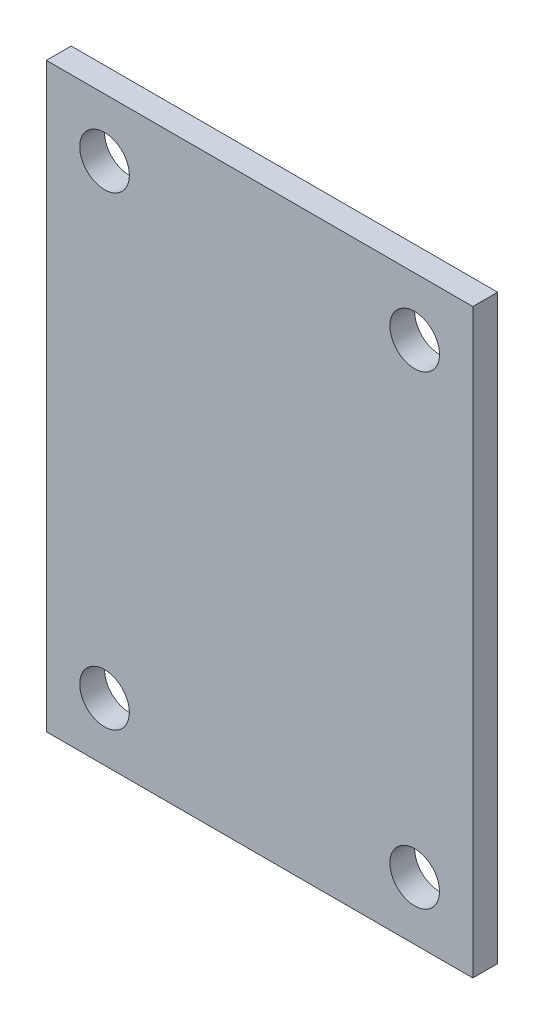
ISO-10303-21;
HEADER;
FILE_DESCRIPTION(('STEP AP214'),'2;1');
FILE_NAME('part.step','',(''),(''),'','','');
FILE_SCHEMA(('AUTOMOTIVE_DESIGN { 1 0 10303 214 1 1 1 1 }'));
ENDSEC;
DATA;
#1=APPLICATION_CONTEXT('core data for automotive mechanical design processes');
#2=APPLICATION_PROTOCOL_DEFINITION('international standard','automotive_design',2000,#1);
#3=PRODUCT_CONTEXT('',#1,'mechanical');
#4=PRODUCT('Part','Part','',(#3));
#5=PRODUCT_RELATED_PRODUCT_CATEGORY('part','',(#4));
#6=PRODUCT_DEFINITION_FORMATION('','',#4);
#7=PRODUCT_DEFINITION_CONTEXT('part definition',#1,'design');
#8=PRODUCT_DEFINITION('design','',#6,#7);
#9=PRODUCT_DEFINITION_SHAPE('','',#8);
#10=(LENGTH_UNIT() NAMED_UNIT(*) SI_UNIT(.MILLI.,.METRE.));
#11=(NAMED_UNIT(*) PLANE_ANGLE_UNIT() SI_UNIT($,.RADIAN.));
#12=(NAMED_UNIT(*) SI_UNIT($,.STERADIAN.) SOLID_ANGLE_UNIT());
#13=UNCERTAINTY_MEASURE_WITH_UNIT(LENGTH_MEASURE(1.E-05),#10,'distance_accuracy_value','');
#14=(GEOMETRIC_REPRESENTATION_CONTEXT(3) GLOBAL_UNCERTAINTY_ASSIGNED_CONTEXT((#13)) GLOBAL_UNIT_ASSIGNED_CONTEXT((#10,
#11,#12)) REPRESENTATION_CONTEXT('',''));
#15=CARTESIAN_POINT('',(0.,0.,0.));
#16=DIRECTION('',(0.,0.,1.));
#17=DIRECTION('',(1.,0.,0.));
#18=AXIS2_PLACEMENT_3D('',#15,#16,#17);
#19=CARTESIAN_POINT('',(13.75,18.75,1.6));
#20=DIRECTION('',(0.,0.,-1.));
#21=DIRECTION('',(-1.,0.,0.));
#22=AXIS2_PLACEMENT_3D('',#19,#20,#21);
#23=PLANE('',#22);
#24=CARTESIAN_POINT('',(10.,-15.,1.6));
#25=DIRECTION('',(0.,0.,1.));
#26=DIRECTION('',(1.,0.,0.));
#27=AXIS2_PLACEMENT_3D('',#24,#25,#26);
#28=CIRCLE('',#27,1.6);
#29=CARTESIAN_POINT('',(11.6,-15.,1.6));
#30=VERTEX_POINT('',#29);
#31=EDGE_CURVE('E119',#30,#30,#28,.T.);
#32=ORIENTED_EDGE('',*,*,#31,.F.);
#33=EDGE_LOOP('',(#32));
#34=FACE_BOUND('',#33,.T.);
#35=CARTESIAN_POINT('',(-10.,15.,1.6));
#36=DIRECTION('',(0.,0.,1.));
#37=DIRECTION('',(1.,0.,0.));
#38=AXIS2_PLACEMENT_3D('',#35,#36,#37);
#39=CIRCLE('',#38,1.6);
#40=CARTESIAN_POINT('',(-8.4,15.,1.6));
#41=VERTEX_POINT('',#40);
#42=EDGE_CURVE('E98',#41,#41,#39,.T.);
#43=ORIENTED_EDGE('',*,*,#42,.F.);
#44=EDGE_LOOP('',(#43));
#45=FACE_BOUND('',#44,.T.);
#46=DIRECTION('',(0.,1.,0.));
#47=VECTOR('',#46,1.);
#48=CARTESIAN_POINT('',(13.75,-18.75,1.6));
#49=LINE('',#48,#47);
#50=CARTESIAN_POINT('',(13.75,-18.75,1.6));
#51=VERTEX_POINT('',#50);
#52=CARTESIAN_POINT('',(13.75,18.75,1.6));
#53=VERTEX_POINT('',#52);
#54=EDGE_CURVE('E83',#51,#53,#49,.T.);
#55=ORIENTED_EDGE('',*,*,#54,.T.);
#56=DIRECTION('',(-1.,0.,0.));
#57=VECTOR('',#56,1.);
#58=CARTESIAN_POINT('',(-13.75,18.75,1.6));
#59=LINE('',#58,#57);
#60=CARTESIAN_POINT('',(-13.75,18.75,1.6));
#61=VERTEX_POINT('',#60);
#62=EDGE_CURVE('E78',#53,#61,#59,.T.);
#63=ORIENTED_EDGE('',*,*,#62,.T.);
#64=DIRECTION('',(0.,-1.,0.));
#65=VECTOR('',#64,1.);
#66=CARTESIAN_POINT('',(-13.75,-18.75,1.6));
#67=LINE('',#66,#65);
#68=CARTESIAN_POINT('',(-13.75,-18.75,1.6));
#69=VERTEX_POINT('',#68);
#70=EDGE_CURVE('E81',#61,#69,#67,.T.);
#71=ORIENTED_EDGE('',*,*,#70,.T.);
#72=DIRECTION('',(1.,0.,0.));
#73=VECTOR('',#72,1.);
#74=CARTESIAN_POINT('',(-13.75,-18.75,1.6));
#75=LINE('',#74,#73);
#76=EDGE_CURVE('E48',#69,#51,#75,.T.);
#77=ORIENTED_EDGE('',*,*,#76,.T.);
#78=EDGE_LOOP('',(#55,#63,#71,#77));
#79=FACE_BOUND('',#78,.T.);
#80=CARTESIAN_POINT('',(10.,15.,1.6));
#81=DIRECTION('',(0.,0.,1.));
#82=DIRECTION('',(1.,0.,0.));
#83=AXIS2_PLACEMENT_3D('',#80,#81,#82);
#84=CIRCLE('',#83,1.6);
#85=CARTESIAN_POINT('',(11.6,15.,1.6));
#86=VERTEX_POINT('',#85);
#87=EDGE_CURVE('E113',#86,#86,#84,.T.);
#88=ORIENTED_EDGE('',*,*,#87,.F.);
#89=EDGE_LOOP('',(#88));
#90=FACE_BOUND('',#89,.T.);
#91=CARTESIAN_POINT('',(-10.,-15.,1.6));
#92=DIRECTION('',(0.,0.,1.));
#93=DIRECTION('',(1.,0.,0.));
#94=AXIS2_PLACEMENT_3D('',#91,#92,#93);
#95=CIRCLE('',#94,1.6);
#96=CARTESIAN_POINT('',(-8.4,-15.,1.6));
#97=VERTEX_POINT('',#96);
#98=EDGE_CURVE('E125',#97,#97,#95,.T.);
#99=ORIENTED_EDGE('',*,*,#98,.F.);
#100=EDGE_LOOP('',(#99));
#101=FACE_BOUND('',#100,.T.);
#102=ADVANCED_FACE('F31',(#34,#45,#79,#90,#101),#23,.F.);
#103=CARTESIAN_POINT('',(13.75,18.75,0.));
#104=DIRECTION('',(0.,0.,-1.));
#105=DIRECTION('',(-1.,0.,0.));
#106=AXIS2_PLACEMENT_3D('',#103,#104,#105);
#107=PLANE('',#106);
#108=CARTESIAN_POINT('',(10.,-15.,0.));
#109=DIRECTION('',(0.,0.,1.));
#110=DIRECTION('',(1.,0.,0.));
#111=AXIS2_PLACEMENT_3D('',#108,#109,#110);
#112=CIRCLE('',#111,1.6);
#113=CARTESIAN_POINT('',(11.6,-15.,0.));
#114=VERTEX_POINT('',#113);
#115=EDGE_CURVE('E122',#114,#114,#112,.T.);
#116=ORIENTED_EDGE('',*,*,#115,.T.);
#117=EDGE_LOOP('',(#116));
#118=FACE_BOUND('',#117,.T.);
#119=CARTESIAN_POINT('',(-10.,15.,0.));
#120=DIRECTION('',(0.,0.,1.));
#121=DIRECTION('',(1.,0.,0.));
#122=AXIS2_PLACEMENT_3D('',#119,#120,#121);
#123=CIRCLE('',#122,1.6);
#124=CARTESIAN_POINT('',(-8.4,15.,0.));
#125=VERTEX_POINT('',#124);
#126=EDGE_CURVE('E110',#125,#125,#123,.T.);
#127=ORIENTED_EDGE('',*,*,#126,.T.);
#128=EDGE_LOOP('',(#127));
#129=FACE_BOUND('',#128,.T.);
#130=DIRECTION('',(0.,1.,0.));
#131=VECTOR('',#130,1.);
#132=CARTESIAN_POINT('',(13.75,-18.75,0.));
#133=LINE('',#132,#131);
#134=CARTESIAN_POINT('',(13.75,-18.75,0.));
#135=VERTEX_POINT('',#134);
#136=CARTESIAN_POINT('',(13.75,18.75,0.));
#137=VERTEX_POINT('',#136);
#138=EDGE_CURVE('E95',#135,#137,#133,.T.);
#139=ORIENTED_EDGE('',*,*,#138,.F.);
#140=DIRECTION('',(1.,0.,0.));
#141=VECTOR('',#140,1.);
#142=CARTESIAN_POINT('',(-13.75,-18.75,0.));
#143=LINE('',#142,#141);
#144=CARTESIAN_POINT('',(-13.75,-18.75,0.));
#145=VERTEX_POINT('',#144);
#146=EDGE_CURVE('E71',#145,#135,#143,.T.);
#147=ORIENTED_EDGE('',*,*,#146,.F.);
#148=DIRECTION('',(0.,-1.,0.));
#149=VECTOR('',#148,1.);
#150=CARTESIAN_POINT('',(-13.75,-18.75,0.));
#151=LINE('',#150,#149);
#152=CARTESIAN_POINT('',(-13.75,18.75,0.));
#153=VERTEX_POINT('',#152);
#154=EDGE_CURVE('E65',#153,#145,#151,.T.);
#155=ORIENTED_EDGE('',*,*,#154,.F.);
#156=DIRECTION('',(-1.,0.,0.));
#157=VECTOR('',#156,1.);
#158=CARTESIAN_POINT('',(-13.75,18.75,0.));
#159=LINE('',#158,#157);
#160=EDGE_CURVE('E87',#137,#153,#159,.T.);
#161=ORIENTED_EDGE('',*,*,#160,.F.);
#162=EDGE_LOOP('',(#139,#147,#155,#161));
#163=FACE_BOUND('',#162,.T.);
#164=CARTESIAN_POINT('',(10.,15.,0.));
#165=DIRECTION('',(0.,0.,1.));
#166=DIRECTION('',(1.,0.,0.));
#167=AXIS2_PLACEMENT_3D('',#164,#165,#166);
#168=CIRCLE('',#167,1.6);
#169=CARTESIAN_POINT('',(11.6,15.,0.));
#170=VERTEX_POINT('',#169);
#171=EDGE_CURVE('E116',#170,#170,#168,.T.);
#172=ORIENTED_EDGE('',*,*,#171,.T.);
#173=EDGE_LOOP('',(#172));
#174=FACE_BOUND('',#173,.T.);
#175=CARTESIAN_POINT('',(-10.,-15.,0.));
#176=DIRECTION('',(0.,0.,1.));
#177=DIRECTION('',(1.,0.,0.));
#178=AXIS2_PLACEMENT_3D('',#175,#176,#177);
#179=CIRCLE('',#178,1.6);
#180=CARTESIAN_POINT('',(-8.4,-15.,0.));
#181=VERTEX_POINT('',#180);
#182=EDGE_CURVE('E128',#181,#181,#179,.T.);
#183=ORIENTED_EDGE('',*,*,#182,.T.);
#184=EDGE_LOOP('',(#183));
#185=FACE_BOUND('',#184,.T.);
#186=ADVANCED_FACE('F106',(#118,#129,#163,#174,#185),#107,.T.);
#187=CARTESIAN_POINT('',(13.75,-18.75,1.6));
#188=DIRECTION('',(-1.,0.,0.));
#189=DIRECTION('',(0.,0.,1.));
#190=AXIS2_PLACEMENT_3D('',#187,#188,#189);
#191=PLANE('',#190);
#192=ORIENTED_EDGE('',*,*,#138,.T.);
#193=DIRECTION('',(0.,0.,-1.));
#194=VECTOR('',#193,1.);
#195=CARTESIAN_POINT('',(13.75,18.75,1.6));
#196=LINE('',#195,#194);
#197=EDGE_CURVE('E11',#53,#137,#196,.T.);
#198=ORIENTED_EDGE('',*,*,#197,.F.);
#199=ORIENTED_EDGE('',*,*,#54,.F.);
#200=DIRECTION('',(0.,0.,-1.));
#201=VECTOR('',#200,1.);
#202=CARTESIAN_POINT('',(13.75,-18.75,1.6));
#203=LINE('',#202,#201);
#204=EDGE_CURVE('E91',#51,#135,#203,.T.);
#205=ORIENTED_EDGE('',*,*,#204,.T.);
#206=EDGE_LOOP('',(#192,#198,#199,#205));
#207=FACE_BOUND('',#206,.T.);
#208=ADVANCED_FACE('F33',(#207),#191,.F.);
#209=CARTESIAN_POINT('',(-13.75,18.75,1.6));
#210=DIRECTION('',(0.,-1.,0.));
#211=DIRECTION('',(0.,0.,-1.));
#212=AXIS2_PLACEMENT_3D('',#209,#210,#211);
#213=PLANE('',#212);
#214=ORIENTED_EDGE('',*,*,#160,.T.);
#215=DIRECTION('',(0.,0.,-1.));
#216=VECTOR('',#215,1.);
#217=CARTESIAN_POINT('',(-13.75,18.75,1.6));
#218=LINE('',#217,#216);
#219=EDGE_CURVE('E40',#61,#153,#218,.T.);
#220=ORIENTED_EDGE('',*,*,#219,.F.);
#221=ORIENTED_EDGE('',*,*,#62,.F.);
#222=ORIENTED_EDGE('',*,*,#197,.T.);
#223=EDGE_LOOP('',(#214,#220,#221,#222));
#224=FACE_BOUND('',#223,.T.);
#225=ADVANCED_FACE('F86',(#224),#213,.F.);
#226=CARTESIAN_POINT('',(-13.75,-18.75,1.6));
#227=DIRECTION('',(1.,0.,0.));
#228=DIRECTION('',(0.,0.,-1.));
#229=AXIS2_PLACEMENT_3D('',#226,#227,#228);
#230=PLANE('',#229);
#231=ORIENTED_EDGE('',*,*,#154,.T.);
#232=DIRECTION('',(0.,0.,-1.));
#233=VECTOR('',#232,1.);
#234=CARTESIAN_POINT('',(-13.75,-18.75,1.6));
#235=LINE('',#234,#233);
#236=EDGE_CURVE('E88',#69,#145,#235,.T.);
#237=ORIENTED_EDGE('',*,*,#236,.F.);
#238=ORIENTED_EDGE('',*,*,#70,.F.);
#239=ORIENTED_EDGE('',*,*,#219,.T.);
#240=EDGE_LOOP('',(#231,#237,#238,#239));
#241=FACE_BOUND('',#240,.T.);
#242=ADVANCED_FACE('F89',(#241),#230,.F.);
#243=CARTESIAN_POINT('',(-13.75,-18.75,1.6));
#244=DIRECTION('',(0.,1.,0.));
#245=DIRECTION('',(0.,0.,1.));
#246=AXIS2_PLACEMENT_3D('',#243,#244,#245);
#247=PLANE('',#246);
#248=ORIENTED_EDGE('',*,*,#146,.T.);
#249=ORIENTED_EDGE('',*,*,#204,.F.);
#250=ORIENTED_EDGE('',*,*,#76,.F.);
#251=ORIENTED_EDGE('',*,*,#236,.T.);
#252=EDGE_LOOP('',(#248,#249,#250,#251));
#253=FACE_BOUND('',#252,.T.);
#254=ADVANCED_FACE('F103',(#253),#247,.F.);
#255=CARTESIAN_POINT('',(-10.,15.,1.6));
#256=DIRECTION('',(0.,0.,-1.));
#257=DIRECTION('',(-1.,0.,0.));
#258=AXIS2_PLACEMENT_3D('',#255,#256,#257);
#259=CYLINDRICAL_SURFACE('',#258,1.6);
#260=ORIENTED_EDGE('',*,*,#42,.T.);
#261=EDGE_LOOP('',(#260));
#262=FACE_BOUND('',#261,.T.);
#263=ORIENTED_EDGE('',*,*,#126,.F.);
#264=EDGE_LOOP('',(#263));
#265=FACE_BOUND('',#264,.T.);
#266=ADVANCED_FACE('F148',(#262,#265),#259,.F.);
#267=CARTESIAN_POINT('',(10.,15.,1.6));
#268=DIRECTION('',(0.,0.,-1.));
#269=DIRECTION('',(-1.,0.,0.));
#270=AXIS2_PLACEMENT_3D('',#267,#268,#269);
#271=CYLINDRICAL_SURFACE('',#270,1.6);
#272=ORIENTED_EDGE('',*,*,#87,.T.);
#273=EDGE_LOOP('',(#272));
#274=FACE_BOUND('',#273,.T.);
#275=ORIENTED_EDGE('',*,*,#171,.F.);
#276=EDGE_LOOP('',(#275));
#277=FACE_BOUND('',#276,.T.);
#278=ADVANCED_FACE('F194',(#274,#277),#271,.F.);
#279=CARTESIAN_POINT('',(10.,-15.,1.6));
#280=DIRECTION('',(0.,0.,-1.));
#281=DIRECTION('',(-1.,0.,0.));
#282=AXIS2_PLACEMENT_3D('',#279,#280,#281);
#283=CYLINDRICAL_SURFACE('',#282,1.6);
#284=ORIENTED_EDGE('',*,*,#31,.T.);
#285=EDGE_LOOP('',(#284));
#286=FACE_BOUND('',#285,.T.);
#287=ORIENTED_EDGE('',*,*,#115,.F.);
#288=EDGE_LOOP('',(#287));
#289=FACE_BOUND('',#288,.T.);
#290=ADVANCED_FACE('F202',(#286,#289),#283,.F.);
#291=CARTESIAN_POINT('',(-10.,-15.,1.6));
#292=DIRECTION('',(0.,0.,-1.));
#293=DIRECTION('',(-1.,0.,0.));
#294=AXIS2_PLACEMENT_3D('',#291,#292,#293);
#295=CYLINDRICAL_SURFACE('',#294,1.6);
#296=ORIENTED_EDGE('',*,*,#98,.T.);
#297=EDGE_LOOP('',(#296));
#298=FACE_BOUND('',#297,.T.);
#299=ORIENTED_EDGE('',*,*,#182,.F.);
#300=EDGE_LOOP('',(#299));
#301=FACE_BOUND('',#300,.T.);
#302=ADVANCED_FACE('F134',(#298,#301),#295,.F.);
#303=CLOSED_SHELL('',(#102,#186,#208,#225,#242,#254,#266,#278,#290,#302));
#304=MANIFOLD_SOLID_BREP('B2',#303);
#305=ADVANCED_BREP_SHAPE_REPRESENTATION('',(#18,#304),#14);
#306=SHAPE_DEFINITION_REPRESENTATION(#9,#305);
ENDSEC;
END-ISO-10303-21;
